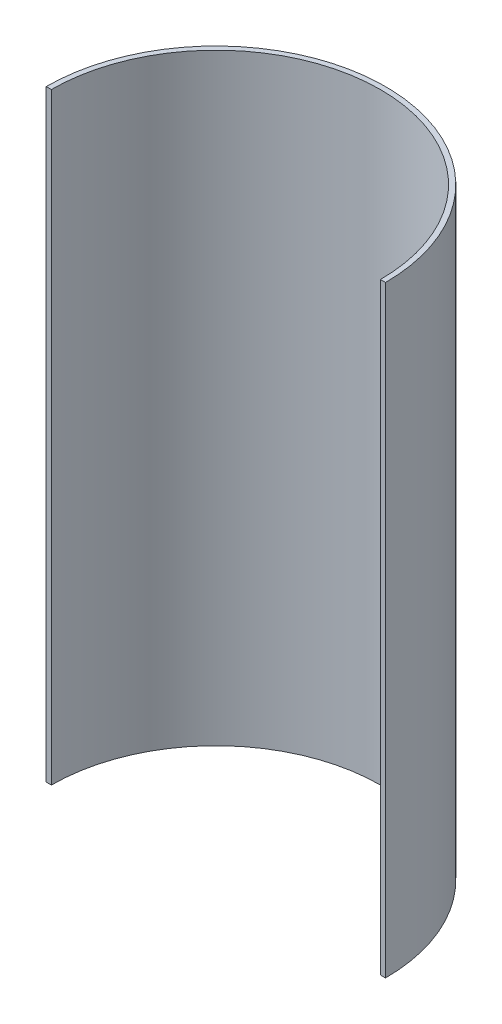
ISO-10303-21;
HEADER;
FILE_DESCRIPTION(('STEP AP214'),'2;1');
FILE_NAME('part.step','',(''),(''),'','','');
FILE_SCHEMA(('AUTOMOTIVE_DESIGN { 1 0 10303 214 1 1 1 1 }'));
ENDSEC;
DATA;
#1=APPLICATION_CONTEXT('core data for automotive mechanical design processes');
#2=APPLICATION_PROTOCOL_DEFINITION('international standard','automotive_design',2000,#1);
#3=PRODUCT_CONTEXT('',#1,'mechanical');
#4=PRODUCT('Part','Part','',(#3));
#5=PRODUCT_RELATED_PRODUCT_CATEGORY('part','',(#4));
#6=PRODUCT_DEFINITION_FORMATION('','',#4);
#7=PRODUCT_DEFINITION_CONTEXT('part definition',#1,'design');
#8=PRODUCT_DEFINITION('design','',#6,#7);
#9=PRODUCT_DEFINITION_SHAPE('','',#8);
#10=(LENGTH_UNIT() NAMED_UNIT(*) SI_UNIT(.MILLI.,.METRE.));
#11=(NAMED_UNIT(*) PLANE_ANGLE_UNIT() SI_UNIT($,.RADIAN.));
#12=(NAMED_UNIT(*) SI_UNIT($,.STERADIAN.) SOLID_ANGLE_UNIT());
#13=UNCERTAINTY_MEASURE_WITH_UNIT(LENGTH_MEASURE(1.E-05),#10,'distance_accuracy_value','');
#14=(GEOMETRIC_REPRESENTATION_CONTEXT(3) GLOBAL_UNCERTAINTY_ASSIGNED_CONTEXT((#13)) GLOBAL_UNIT_ASSIGNED_CONTEXT((#10,
#11,#12)) REPRESENTATION_CONTEXT('',''));
#15=CARTESIAN_POINT('',(0.,0.,0.));
#16=DIRECTION('',(0.,0.,1.));
#17=DIRECTION('',(1.,0.,0.));
#18=AXIS2_PLACEMENT_3D('',#15,#16,#17);
#19=CARTESIAN_POINT('',(260.75,940.,0.));
#20=DIRECTION('',(0.,-1.,0.));
#21=DIRECTION('',(0.,0.,-1.));
#22=AXIS2_PLACEMENT_3D('',#19,#20,#21);
#23=CYLINDRICAL_SURFACE('',#22,256.75);
#24=CARTESIAN_POINT('',(260.75,0.,0.));
#25=DIRECTION('',(0.,-1.,0.));
#26=DIRECTION('',(0.,0.,-1.));
#27=AXIS2_PLACEMENT_3D('',#24,#25,#26);
#28=CIRCLE('',#27,256.75);
#29=CARTESIAN_POINT('',(4.,0.,0.));
#30=VERTEX_POINT('',#29);
#31=CARTESIAN_POINT('',(517.5,0.,0.));
#32=VERTEX_POINT('',#31);
#33=EDGE_CURVE('E98',#30,#32,#28,.T.);
#34=ORIENTED_EDGE('',*,*,#33,.T.);
#35=DIRECTION('',(0.,-1.,0.));
#36=VECTOR('',#35,1.);
#37=CARTESIAN_POINT('',(517.5,940.,0.));
#38=LINE('',#37,#36);
#39=CARTESIAN_POINT('',(517.5,940.,0.));
#40=VERTEX_POINT('',#39);
#41=EDGE_CURVE('E11',#40,#32,#38,.T.);
#42=ORIENTED_EDGE('',*,*,#41,.F.);
#43=CARTESIAN_POINT('',(260.75,940.,0.));
#44=DIRECTION('',(0.,-1.,0.));
#45=DIRECTION('',(0.,0.,-1.));
#46=AXIS2_PLACEMENT_3D('',#43,#44,#45);
#47=CIRCLE('',#46,256.75);
#48=CARTESIAN_POINT('',(4.,940.,0.));
#49=VERTEX_POINT('',#48);
#50=EDGE_CURVE('E86',#49,#40,#47,.T.);
#51=ORIENTED_EDGE('',*,*,#50,.F.);
#52=DIRECTION('',(0.,-1.,0.));
#53=VECTOR('',#52,1.);
#54=CARTESIAN_POINT('',(4.,940.,0.));
#55=LINE('',#54,#53);
#56=EDGE_CURVE('E94',#49,#30,#55,.T.);
#57=ORIENTED_EDGE('',*,*,#56,.T.);
#58=EDGE_LOOP('',(#34,#42,#51,#57));
#59=FACE_BOUND('',#58,.T.);
#60=ADVANCED_FACE('F35',(#59),#23,.F.);
#61=CARTESIAN_POINT('',(525.5,940.,0.));
#62=DIRECTION('',(0.,0.,-1.));
#63=DIRECTION('',(-1.,0.,0.));
#64=AXIS2_PLACEMENT_3D('',#61,#62,#63);
#65=PLANE('',#64);
#66=DIRECTION('',(1.,0.,0.));
#67=VECTOR('',#66,1.);
#68=CARTESIAN_POINT('',(525.5,0.,0.));
#69=LINE('',#68,#67);
#70=CARTESIAN_POINT('',(525.5,0.,0.));
#71=VERTEX_POINT('',#70);
#72=EDGE_CURVE('E90',#32,#71,#69,.T.);
#73=ORIENTED_EDGE('',*,*,#72,.T.);
#74=DIRECTION('',(0.,-1.,0.));
#75=VECTOR('',#74,1.);
#76=CARTESIAN_POINT('',(525.5,940.,0.));
#77=LINE('',#76,#75);
#78=CARTESIAN_POINT('',(525.5,940.,0.));
#79=VERTEX_POINT('',#78);
#80=EDGE_CURVE('E43',#79,#71,#77,.T.);
#81=ORIENTED_EDGE('',*,*,#80,.F.);
#82=DIRECTION('',(1.,0.,0.));
#83=VECTOR('',#82,1.);
#84=CARTESIAN_POINT('',(525.5,940.,0.));
#85=LINE('',#84,#83);
#86=EDGE_CURVE('E81',#40,#79,#85,.T.);
#87=ORIENTED_EDGE('',*,*,#86,.F.);
#88=ORIENTED_EDGE('',*,*,#41,.T.);
#89=EDGE_LOOP('',(#73,#81,#87,#88));
#90=FACE_BOUND('',#89,.T.);
#91=ADVANCED_FACE('F89',(#90),#65,.F.);
#92=CARTESIAN_POINT('',(260.75,940.,0.));
#93=DIRECTION('',(0.,-1.,0.));
#94=DIRECTION('',(0.,0.,-1.));
#95=AXIS2_PLACEMENT_3D('',#92,#93,#94);
#96=CYLINDRICAL_SURFACE('',#95,264.75);
#97=CARTESIAN_POINT('',(260.75,0.,0.));
#98=DIRECTION('',(0.,1.,0.));
#99=DIRECTION('',(0.,0.,-1.));
#100=AXIS2_PLACEMENT_3D('',#97,#98,#99);
#101=CIRCLE('',#100,264.75);
#102=CARTESIAN_POINT('',(-4.,0.,0.));
#103=VERTEX_POINT('',#102);
#104=EDGE_CURVE('E68',#71,#103,#101,.T.);
#105=ORIENTED_EDGE('',*,*,#104,.T.);
#106=DIRECTION('',(0.,-1.,0.));
#107=VECTOR('',#106,1.);
#108=CARTESIAN_POINT('',(-4.,940.,0.));
#109=LINE('',#108,#107);
#110=CARTESIAN_POINT('',(-4.,940.,0.));
#111=VERTEX_POINT('',#110);
#112=EDGE_CURVE('E91',#111,#103,#109,.T.);
#113=ORIENTED_EDGE('',*,*,#112,.F.);
#114=CARTESIAN_POINT('',(260.75,940.,0.));
#115=DIRECTION('',(0.,1.,0.));
#116=DIRECTION('',(0.,0.,-1.));
#117=AXIS2_PLACEMENT_3D('',#114,#115,#116);
#118=CIRCLE('',#117,264.75);
#119=EDGE_CURVE('E84',#79,#111,#118,.T.);
#120=ORIENTED_EDGE('',*,*,#119,.F.);
#121=ORIENTED_EDGE('',*,*,#80,.T.);
#122=EDGE_LOOP('',(#105,#113,#120,#121));
#123=FACE_BOUND('',#122,.T.);
#124=ADVANCED_FACE('F92',(#123),#96,.T.);
#125=CARTESIAN_POINT('',(-4.,940.,0.));
#126=DIRECTION('',(0.,0.,-1.));
#127=DIRECTION('',(-1.,0.,0.));
#128=AXIS2_PLACEMENT_3D('',#125,#126,#127);
#129=PLANE('',#128);
#130=DIRECTION('',(1.,0.,0.));
#131=VECTOR('',#130,1.);
#132=CARTESIAN_POINT('',(-4.,0.,0.));
#133=LINE('',#132,#131);
#134=EDGE_CURVE('E74',#103,#30,#133,.T.);
#135=ORIENTED_EDGE('',*,*,#134,.T.);
#136=ORIENTED_EDGE('',*,*,#56,.F.);
#137=DIRECTION('',(1.,0.,0.));
#138=VECTOR('',#137,1.);
#139=CARTESIAN_POINT('',(-4.,940.,0.));
#140=LINE('',#139,#138);
#141=EDGE_CURVE('E51',#111,#49,#140,.T.);
#142=ORIENTED_EDGE('',*,*,#141,.F.);
#143=ORIENTED_EDGE('',*,*,#112,.T.);
#144=EDGE_LOOP('',(#135,#136,#142,#143));
#145=FACE_BOUND('',#144,.T.);
#146=ADVANCED_FACE('F105',(#145),#129,.F.);
#147=CARTESIAN_POINT('',(260.75,940.,0.));
#148=DIRECTION('',(0.,-1.,0.));
#149=DIRECTION('',(0.,0.,-1.));
#150=AXIS2_PLACEMENT_3D('',#147,#148,#149);
#151=PLANE('',#150);
#152=ORIENTED_EDGE('',*,*,#50,.T.);
#153=ORIENTED_EDGE('',*,*,#86,.T.);
#154=ORIENTED_EDGE('',*,*,#119,.T.);
#155=ORIENTED_EDGE('',*,*,#141,.T.);
#156=EDGE_LOOP('',(#152,#153,#154,#155));
#157=FACE_BOUND('',#156,.T.);
#158=ADVANCED_FACE('F82',(#157),#151,.F.);
#159=CARTESIAN_POINT('',(260.75,0.,0.));
#160=DIRECTION('',(0.,-1.,0.));
#161=DIRECTION('',(0.,0.,-1.));
#162=AXIS2_PLACEMENT_3D('',#159,#160,#161);
#163=PLANE('',#162);
#164=ORIENTED_EDGE('',*,*,#33,.F.);
#165=ORIENTED_EDGE('',*,*,#134,.F.);
#166=ORIENTED_EDGE('',*,*,#104,.F.);
#167=ORIENTED_EDGE('',*,*,#72,.F.);
#168=EDGE_LOOP('',(#164,#165,#166,#167));
#169=FACE_BOUND('',#168,.T.);
#170=ADVANCED_FACE('F108',(#169),#163,.T.);
#171=CLOSED_SHELL('',(#60,#91,#124,#146,#158,#170));
#172=MANIFOLD_SOLID_BREP('B2',#171);
#173=ADVANCED_BREP_SHAPE_REPRESENTATION('',(#18,#172),#14);
#174=SHAPE_DEFINITION_REPRESENTATION(#9,#173);
ENDSEC;
END-ISO-10303-21;
